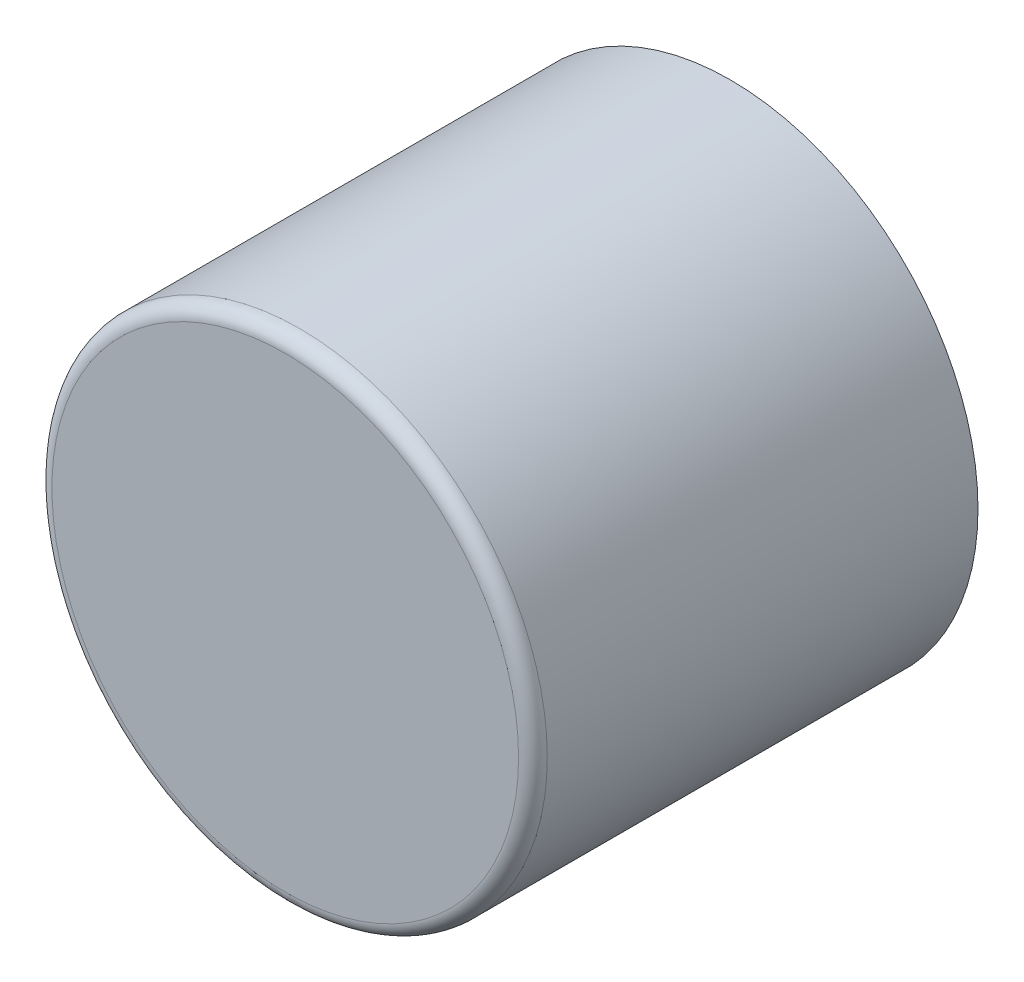
ISO-10303-21;
HEADER;
FILE_DESCRIPTION(('STEP AP214'),'2;1');
FILE_NAME('part.step','',(''),(''),'','','');
FILE_SCHEMA(('AUTOMOTIVE_DESIGN { 1 0 10303 214 1 1 1 1 }'));
ENDSEC;
DATA;
#1=APPLICATION_CONTEXT('core data for automotive mechanical design processes');
#2=APPLICATION_PROTOCOL_DEFINITION('international standard','automotive_design',2000,#1);
#3=PRODUCT_CONTEXT('',#1,'mechanical');
#4=PRODUCT('Part','Part','',(#3));
#5=PRODUCT_RELATED_PRODUCT_CATEGORY('part','',(#4));
#6=PRODUCT_DEFINITION_FORMATION('','',#4);
#7=PRODUCT_DEFINITION_CONTEXT('part definition',#1,'design');
#8=PRODUCT_DEFINITION('design','',#6,#7);
#9=PRODUCT_DEFINITION_SHAPE('','',#8);
#10=(LENGTH_UNIT() NAMED_UNIT(*) SI_UNIT(.MILLI.,.METRE.));
#11=(NAMED_UNIT(*) PLANE_ANGLE_UNIT() SI_UNIT($,.RADIAN.));
#12=(NAMED_UNIT(*) SI_UNIT($,.STERADIAN.) SOLID_ANGLE_UNIT());
#13=UNCERTAINTY_MEASURE_WITH_UNIT(LENGTH_MEASURE(1.E-05),#10,'distance_accuracy_value','');
#14=(GEOMETRIC_REPRESENTATION_CONTEXT(3) GLOBAL_UNCERTAINTY_ASSIGNED_CONTEXT((#13)) GLOBAL_UNIT_ASSIGNED_CONTEXT((#10,
#11,#12)) REPRESENTATION_CONTEXT('',''));
#15=CARTESIAN_POINT('',(0.,0.,0.));
#16=DIRECTION('',(0.,0.,1.));
#17=DIRECTION('',(1.,0.,0.));
#18=AXIS2_PLACEMENT_3D('',#15,#16,#17);
#19=CARTESIAN_POINT('',(0.,0.,31.));
#20=DIRECTION('',(0.,0.,-1.));
#21=DIRECTION('',(-1.,0.,0.));
#22=AXIS2_PLACEMENT_3D('',#19,#20,#21);
#23=CYLINDRICAL_SURFACE('',#22,17.25);
#24=CARTESIAN_POINT('',(0.,0.,30.));
#25=DIRECTION('',(0.,0.,1.));
#26=DIRECTION('',(1.,0.,0.));
#27=AXIS2_PLACEMENT_3D('',#24,#25,#26);
#28=CIRCLE('',#27,17.25);
#29=CARTESIAN_POINT('',(17.25,0.,30.));
#30=VERTEX_POINT('',#29);
#31=EDGE_CURVE('E10',#30,#30,#28,.F.);
#32=ORIENTED_EDGE('',*,*,#31,.T.);
#33=EDGE_LOOP('',(#32));
#34=FACE_BOUND('',#33,.T.);
#35=CARTESIAN_POINT('',(0.,0.,0.));
#36=DIRECTION('',(0.,0.,1.));
#37=DIRECTION('',(1.,0.,0.));
#38=AXIS2_PLACEMENT_3D('',#35,#36,#37);
#39=CIRCLE('',#38,17.25);
#40=CARTESIAN_POINT('',(17.25,0.,0.));
#41=VERTEX_POINT('',#40);
#42=EDGE_CURVE('E45',#41,#41,#39,.T.);
#43=ORIENTED_EDGE('',*,*,#42,.T.);
#44=EDGE_LOOP('',(#43));
#45=FACE_BOUND('',#44,.T.);
#46=ADVANCED_FACE('F34',(#34,#45),#23,.T.);
#47=CARTESIAN_POINT('',(0.,0.,31.));
#48=DIRECTION('',(0.,0.,1.));
#49=DIRECTION('',(1.,0.,0.));
#50=AXIS2_PLACEMENT_3D('',#47,#48,#49);
#51=PLANE('',#50);
#52=CARTESIAN_POINT('',(0.,0.,31.));
#53=DIRECTION('',(0.,0.,1.));
#54=DIRECTION('',(1.,0.,0.));
#55=AXIS2_PLACEMENT_3D('',#52,#53,#54);
#56=CIRCLE('',#55,16.25);
#57=CARTESIAN_POINT('',(16.25,0.,31.));
#58=VERTEX_POINT('',#57);
#59=EDGE_CURVE('E41',#58,#58,#56,.T.);
#60=ORIENTED_EDGE('',*,*,#59,.T.);
#61=EDGE_LOOP('',(#60));
#62=FACE_BOUND('',#61,.T.);
#63=ADVANCED_FACE('F55',(#62),#51,.T.);
#64=CARTESIAN_POINT('',(0.,0.,0.));
#65=DIRECTION('',(0.,0.,1.));
#66=DIRECTION('',(1.,0.,0.));
#67=AXIS2_PLACEMENT_3D('',#64,#65,#66);
#68=PLANE('',#67);
#69=ORIENTED_EDGE('',*,*,#42,.F.);
#70=EDGE_LOOP('',(#69));
#71=FACE_BOUND('',#70,.T.);
#72=ADVANCED_FACE('F53',(#71),#68,.F.);
#73=CARTESIAN_POINT('',(0.,0.,30.));
#74=DIRECTION('',(0.,0.,1.));
#75=DIRECTION('',(1.,0.,0.));
#76=AXIS2_PLACEMENT_3D('',#73,#74,#75);
#77=TOROIDAL_SURFACE('',#76,16.25,1.);
#78=ORIENTED_EDGE('',*,*,#31,.F.);
#79=EDGE_LOOP('',(#78));
#80=FACE_BOUND('',#79,.T.);
#81=ORIENTED_EDGE('',*,*,#59,.F.);
#82=EDGE_LOOP('',(#81));
#83=FACE_BOUND('',#82,.T.);
#84=ADVANCED_FACE('F36',(#80,#83),#77,.T.);
#85=CLOSED_SHELL('',(#46,#63,#72,#84));
#86=MANIFOLD_SOLID_BREP('B2',#85);
#87=ADVANCED_BREP_SHAPE_REPRESENTATION('',(#18,#86),#14);
#88=SHAPE_DEFINITION_REPRESENTATION(#9,#87);
ENDSEC;
END-ISO-10303-21;
